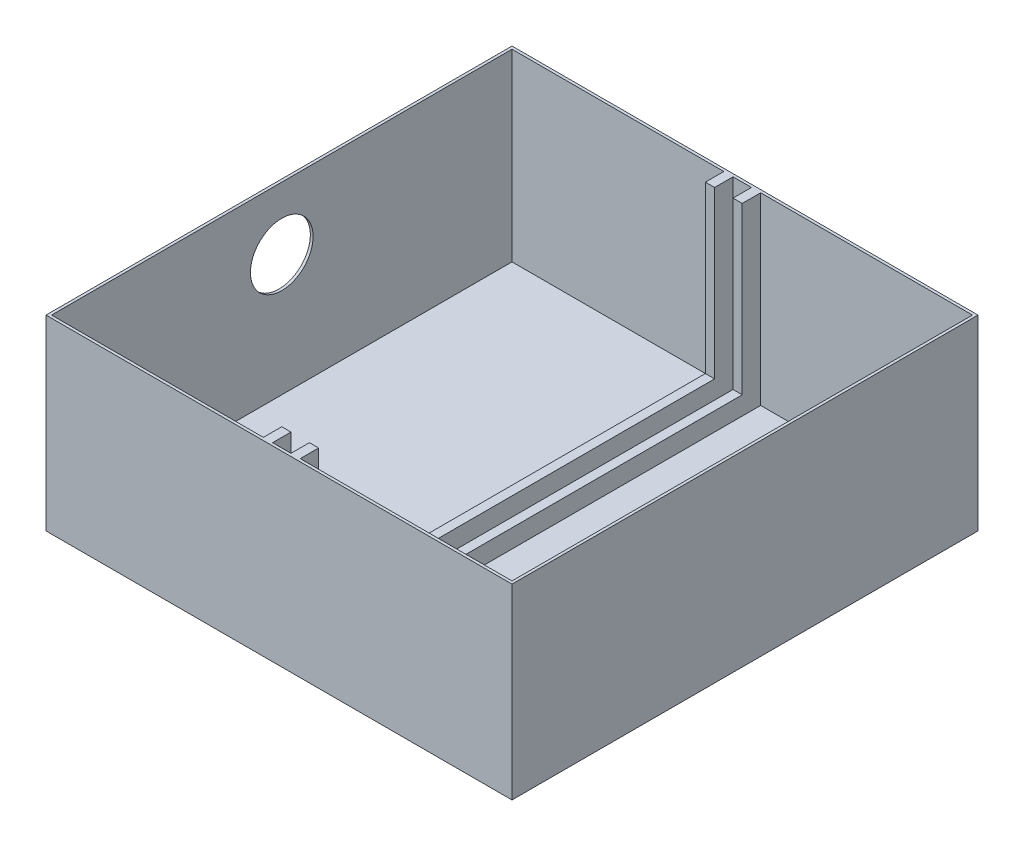
ISO-10303-21;
HEADER;
FILE_DESCRIPTION(('STEP AP214'),'2;1');
FILE_NAME('part.step','',(''),(''),'','','');
FILE_SCHEMA(('AUTOMOTIVE_DESIGN { 1 0 10303 214 1 1 1 1 }'));
ENDSEC;
DATA;
#1=APPLICATION_CONTEXT('core data for automotive mechanical design processes');
#2=APPLICATION_PROTOCOL_DEFINITION('international standard','automotive_design',2000,#1);
#3=PRODUCT_CONTEXT('',#1,'mechanical');
#4=PRODUCT('Part','Part','',(#3));
#5=PRODUCT_RELATED_PRODUCT_CATEGORY('part','',(#4));
#6=PRODUCT_DEFINITION_FORMATION('','',#4);
#7=PRODUCT_DEFINITION_CONTEXT('part definition',#1,'design');
#8=PRODUCT_DEFINITION('design','',#6,#7);
#9=PRODUCT_DEFINITION_SHAPE('','',#8);
#10=(LENGTH_UNIT() NAMED_UNIT(*) SI_UNIT(.MILLI.,.METRE.));
#11=(NAMED_UNIT(*) PLANE_ANGLE_UNIT() SI_UNIT($,.RADIAN.));
#12=(NAMED_UNIT(*) SI_UNIT($,.STERADIAN.) SOLID_ANGLE_UNIT());
#13=UNCERTAINTY_MEASURE_WITH_UNIT(LENGTH_MEASURE(1.E-05),#10,'distance_accuracy_value','');
#14=(GEOMETRIC_REPRESENTATION_CONTEXT(3) GLOBAL_UNCERTAINTY_ASSIGNED_CONTEXT((#13)) GLOBAL_UNIT_ASSIGNED_CONTEXT((#10,
#11,#12)) REPRESENTATION_CONTEXT('',''));
#15=CARTESIAN_POINT('',(0.,0.,0.));
#16=DIRECTION('',(0.,0.,1.));
#17=DIRECTION('',(1.,0.,0.));
#18=AXIS2_PLACEMENT_3D('',#15,#16,#17);
#19=CARTESIAN_POINT('',(0.,1.5,0.));
#20=DIRECTION('',(0.,1.,0.));
#21=DIRECTION('',(0.,0.,1.));
#22=AXIS2_PLACEMENT_3D('',#19,#20,#21);
#23=PLANE('',#22);
#24=DIRECTION('',(0.,0.,1.));
#25=VECTOR('',#24,1.);
#26=CARTESIAN_POINT('',(-5.,1.5,0.));
#27=LINE('',#26,#25);
#28=CARTESIAN_POINT('',(-5.,1.5,-125.));
#29=VERTEX_POINT('',#28);
#30=CARTESIAN_POINT('',(-5.,1.5,125.));
#31=VERTEX_POINT('',#30);
#32=EDGE_CURVE('E299',#29,#31,#27,.T.);
#33=ORIENTED_EDGE('',*,*,#32,.T.);
#34=DIRECTION('',(1.,0.,0.));
#35=VECTOR('',#34,1.);
#36=CARTESIAN_POINT('',(-126.5,1.5,125.));
#37=LINE('',#36,#35);
#38=CARTESIAN_POINT('',(5.,1.5,125.));
#39=VERTEX_POINT('',#38);
#40=EDGE_CURVE('E269',#31,#39,#37,.T.);
#41=ORIENTED_EDGE('',*,*,#40,.T.);
#42=DIRECTION('',(0.,0.,1.));
#43=VECTOR('',#42,1.);
#44=CARTESIAN_POINT('',(5.,1.5,0.));
#45=LINE('',#44,#43);
#46=CARTESIAN_POINT('',(5.,1.5,-125.));
#47=VERTEX_POINT('',#46);
#48=EDGE_CURVE('E317',#47,#39,#45,.T.);
#49=ORIENTED_EDGE('',*,*,#48,.F.);
#50=DIRECTION('',(-1.,0.,0.));
#51=VECTOR('',#50,1.);
#52=CARTESIAN_POINT('',(-126.5,1.5,-125.));
#53=LINE('',#52,#51);
#54=EDGE_CURVE('E284',#47,#29,#53,.T.);
#55=ORIENTED_EDGE('',*,*,#54,.T.);
#56=EDGE_LOOP('',(#33,#41,#49,#55));
#57=FACE_BOUND('',#56,.T.);
#58=ADVANCED_FACE('F43',(#57),#23,.T.);
#59=CARTESIAN_POINT('',(-125.,1.5,125.));
#60=VERTEX_POINT('',#59);
#61=CARTESIAN_POINT('',(-10.,1.5,125.));
#62=VERTEX_POINT('',#61);
#63=EDGE_CURVE('E266',#60,#62,#37,.T.);
#64=ORIENTED_EDGE('',*,*,#63,.T.);
#65=DIRECTION('',(0.,0.,-1.));
#66=VECTOR('',#65,1.);
#67=CARTESIAN_POINT('',(-10.,1.5,0.));
#68=LINE('',#67,#66);
#69=CARTESIAN_POINT('',(-10.,1.5,-125.));
#70=VERTEX_POINT('',#69);
#71=EDGE_CURVE('E214',#62,#70,#68,.T.);
#72=ORIENTED_EDGE('',*,*,#71,.T.);
#73=CARTESIAN_POINT('',(-125.,1.5,-125.));
#74=VERTEX_POINT('',#73);
#75=EDGE_CURVE('E285',#70,#74,#53,.T.);
#76=ORIENTED_EDGE('',*,*,#75,.T.);
#77=DIRECTION('',(0.,0.,1.));
#78=VECTOR('',#77,1.);
#79=CARTESIAN_POINT('',(-125.,1.5,-126.5));
#80=LINE('',#79,#78);
#81=EDGE_CURVE('E274',#74,#60,#80,.T.);
#82=ORIENTED_EDGE('',*,*,#81,.T.);
#83=EDGE_LOOP('',(#64,#72,#76,#82));
#84=FACE_BOUND('',#83,.T.);
#85=ADVANCED_FACE('F507',(#84),#23,.T.);
#86=CARTESIAN_POINT('',(-126.5,101.5,125.));
#87=DIRECTION('',(0.,0.,-1.));
#88=DIRECTION('',(-1.,0.,0.));
#89=AXIS2_PLACEMENT_3D('',#86,#87,#88);
#90=PLANE('',#89);
#91=ORIENTED_EDGE('',*,*,#40,.F.);
#92=DIRECTION('',(0.,-1.,0.));
#93=VECTOR('',#92,1.);
#94=CARTESIAN_POINT('',(-5.,112.680339887499,125.));
#95=LINE('',#94,#93);
#96=CARTESIAN_POINT('',(-5.,101.5,125.));
#97=VERTEX_POINT('',#96);
#98=EDGE_CURVE('E416',#97,#31,#95,.T.);
#99=ORIENTED_EDGE('',*,*,#98,.F.);
#100=DIRECTION('',(1.,0.,0.));
#101=VECTOR('',#100,1.);
#102=CARTESIAN_POINT('',(-126.5,101.5,125.));
#103=LINE('',#102,#101);
#104=CARTESIAN_POINT('',(5.,101.5,125.));
#105=VERTEX_POINT('',#104);
#106=EDGE_CURVE('E67',#97,#105,#103,.T.);
#107=ORIENTED_EDGE('',*,*,#106,.T.);
#108=DIRECTION('',(0.,-1.,0.));
#109=VECTOR('',#108,1.);
#110=CARTESIAN_POINT('',(5.,112.680339887499,125.));
#111=LINE('',#110,#109);
#112=EDGE_CURVE('E234',#105,#39,#111,.T.);
#113=ORIENTED_EDGE('',*,*,#112,.T.);
#114=EDGE_LOOP('',(#91,#99,#107,#113));
#115=FACE_BOUND('',#114,.T.);
#116=ADVANCED_FACE('F513',(#115),#90,.T.);
#117=CARTESIAN_POINT('',(-125.,101.5,125.));
#118=VERTEX_POINT('',#117);
#119=CARTESIAN_POINT('',(-10.,101.5,125.));
#120=VERTEX_POINT('',#119);
#121=EDGE_CURVE('E230',#118,#120,#103,.T.);
#122=ORIENTED_EDGE('',*,*,#121,.T.);
#123=DIRECTION('',(0.,-1.,0.));
#124=VECTOR('',#123,1.);
#125=CARTESIAN_POINT('',(-10.,112.680339887499,125.));
#126=LINE('',#125,#124);
#127=EDGE_CURVE('E207',#120,#62,#126,.T.);
#128=ORIENTED_EDGE('',*,*,#127,.T.);
#129=ORIENTED_EDGE('',*,*,#63,.F.);
#130=DIRECTION('',(0.,-1.,0.));
#131=VECTOR('',#130,1.);
#132=CARTESIAN_POINT('',(-125.,101.5,125.));
#133=LINE('',#132,#131);
#134=EDGE_CURVE('E238',#118,#60,#133,.T.);
#135=ORIENTED_EDGE('',*,*,#134,.F.);
#136=EDGE_LOOP('',(#122,#128,#129,#135));
#137=FACE_BOUND('',#136,.T.);
#138=ADVANCED_FACE('F236',(#137),#90,.T.);
#139=DIRECTION('',(0.,0.,-1.));
#140=VECTOR('',#139,1.);
#141=CARTESIAN_POINT('',(10.,1.5,0.));
#142=LINE('',#141,#140);
#143=CARTESIAN_POINT('',(10.,1.5,125.));
#144=VERTEX_POINT('',#143);
#145=CARTESIAN_POINT('',(10.,1.5,-125.));
#146=VERTEX_POINT('',#145);
#147=EDGE_CURVE('E322',#144,#146,#142,.T.);
#148=ORIENTED_EDGE('',*,*,#147,.F.);
#149=CARTESIAN_POINT('',(125.,1.5,125.));
#150=VERTEX_POINT('',#149);
#151=EDGE_CURVE('E270',#144,#150,#37,.T.);
#152=ORIENTED_EDGE('',*,*,#151,.T.);
#153=DIRECTION('',(0.,0.,-1.));
#154=VECTOR('',#153,1.);
#155=CARTESIAN_POINT('',(125.,1.5,-126.5));
#156=LINE('',#155,#154);
#157=CARTESIAN_POINT('',(125.,1.5,-125.));
#158=VERTEX_POINT('',#157);
#159=EDGE_CURVE('E291',#150,#158,#156,.T.);
#160=ORIENTED_EDGE('',*,*,#159,.T.);
#161=EDGE_CURVE('E277',#158,#146,#53,.T.);
#162=ORIENTED_EDGE('',*,*,#161,.T.);
#163=EDGE_LOOP('',(#148,#152,#160,#162));
#164=FACE_BOUND('',#163,.T.);
#165=ADVANCED_FACE('F509',(#164),#23,.T.);
#166=ORIENTED_EDGE('',*,*,#151,.F.);
#167=DIRECTION('',(0.,-1.,0.));
#168=VECTOR('',#167,1.);
#169=CARTESIAN_POINT('',(10.,112.680339887499,125.));
#170=LINE('',#169,#168);
#171=CARTESIAN_POINT('',(10.,101.5,125.));
#172=VERTEX_POINT('',#171);
#173=EDGE_CURVE('E59',#172,#144,#170,.T.);
#174=ORIENTED_EDGE('',*,*,#173,.F.);
#175=CARTESIAN_POINT('',(125.,101.5,125.));
#176=VERTEX_POINT('',#175);
#177=EDGE_CURVE('E243',#172,#176,#103,.T.);
#178=ORIENTED_EDGE('',*,*,#177,.T.);
#179=DIRECTION('',(0.,-1.,0.));
#180=VECTOR('',#179,1.);
#181=CARTESIAN_POINT('',(125.,101.5,125.));
#182=LINE('',#181,#180);
#183=EDGE_CURVE('E241',#176,#150,#182,.T.);
#184=ORIENTED_EDGE('',*,*,#183,.T.);
#185=EDGE_LOOP('',(#166,#174,#178,#184));
#186=FACE_BOUND('',#185,.T.);
#187=ADVANCED_FACE('F517',(#186),#90,.T.);
#188=CARTESIAN_POINT('',(-126.5,101.5,-125.));
#189=DIRECTION('',(0.,0.,1.));
#190=DIRECTION('',(1.,0.,0.));
#191=AXIS2_PLACEMENT_3D('',#188,#189,#190);
#192=PLANE('',#191);
#193=DIRECTION('',(-1.,0.,0.));
#194=VECTOR('',#193,1.);
#195=CARTESIAN_POINT('',(-126.5,101.5,-125.));
#196=LINE('',#195,#194);
#197=CARTESIAN_POINT('',(125.,101.5,-125.));
#198=VERTEX_POINT('',#197);
#199=CARTESIAN_POINT('',(10.,101.5,-125.));
#200=VERTEX_POINT('',#199);
#201=EDGE_CURVE('E254',#198,#200,#196,.T.);
#202=ORIENTED_EDGE('',*,*,#201,.T.);
#203=DIRECTION('',(0.,-1.,0.));
#204=VECTOR('',#203,1.);
#205=CARTESIAN_POINT('',(10.,112.680339887499,-125.));
#206=LINE('',#205,#204);
#207=EDGE_CURVE('E376',#200,#146,#206,.T.);
#208=ORIENTED_EDGE('',*,*,#207,.T.);
#209=ORIENTED_EDGE('',*,*,#161,.F.);
#210=DIRECTION('',(0.,-1.,0.));
#211=VECTOR('',#210,1.);
#212=CARTESIAN_POINT('',(125.,101.5,-125.));
#213=LINE('',#212,#211);
#214=EDGE_CURVE('E281',#198,#158,#213,.T.);
#215=ORIENTED_EDGE('',*,*,#214,.F.);
#216=EDGE_LOOP('',(#202,#208,#209,#215));
#217=FACE_BOUND('',#216,.T.);
#218=ADVANCED_FACE('F523',(#217),#192,.T.);
#219=ORIENTED_EDGE('',*,*,#54,.F.);
#220=DIRECTION('',(0.,-1.,0.));
#221=VECTOR('',#220,1.);
#222=CARTESIAN_POINT('',(5.,112.680339887499,-125.));
#223=LINE('',#222,#221);
#224=CARTESIAN_POINT('',(5.,101.5,-125.));
#225=VERTEX_POINT('',#224);
#226=EDGE_CURVE('E371',#225,#47,#223,.T.);
#227=ORIENTED_EDGE('',*,*,#226,.F.);
#228=CARTESIAN_POINT('',(-5.,101.5,-125.));
#229=VERTEX_POINT('',#228);
#230=EDGE_CURVE('E259',#225,#229,#196,.T.);
#231=ORIENTED_EDGE('',*,*,#230,.T.);
#232=DIRECTION('',(0.,-1.,0.));
#233=VECTOR('',#232,1.);
#234=CARTESIAN_POINT('',(-5.,112.680339887499,-125.));
#235=LINE('',#234,#233);
#236=EDGE_CURVE('E349',#229,#29,#235,.T.);
#237=ORIENTED_EDGE('',*,*,#236,.T.);
#238=EDGE_LOOP('',(#219,#227,#231,#237));
#239=FACE_BOUND('',#238,.T.);
#240=ADVANCED_FACE('F573',(#239),#192,.T.);
#241=ORIENTED_EDGE('',*,*,#75,.F.);
#242=DIRECTION('',(0.,-1.,0.));
#243=VECTOR('',#242,1.);
#244=CARTESIAN_POINT('',(-10.,112.680339887499,-125.));
#245=LINE('',#244,#243);
#246=CARTESIAN_POINT('',(-10.,101.5,-125.));
#247=VERTEX_POINT('',#246);
#248=EDGE_CURVE('E345',#247,#70,#245,.T.);
#249=ORIENTED_EDGE('',*,*,#248,.F.);
#250=CARTESIAN_POINT('',(-125.,101.5,-125.));
#251=VERTEX_POINT('',#250);
#252=EDGE_CURVE('E261',#247,#251,#196,.T.);
#253=ORIENTED_EDGE('',*,*,#252,.T.);
#254=DIRECTION('',(0.,-1.,0.));
#255=VECTOR('',#254,1.);
#256=CARTESIAN_POINT('',(-125.,101.5,-125.));
#257=LINE('',#256,#255);
#258=EDGE_CURVE('E273',#251,#74,#257,.T.);
#259=ORIENTED_EDGE('',*,*,#258,.T.);
#260=EDGE_LOOP('',(#241,#249,#253,#259));
#261=FACE_BOUND('',#260,.T.);
#262=ADVANCED_FACE('F559',(#261),#192,.T.);
#263=CARTESIAN_POINT('',(126.5,101.5,-126.5));
#264=DIRECTION('',(-1.,0.,0.));
#265=DIRECTION('',(0.,0.,1.));
#266=AXIS2_PLACEMENT_3D('',#263,#264,#265);
#267=PLANE('',#266);
#268=DIRECTION('',(0.,0.,-1.));
#269=VECTOR('',#268,1.);
#270=CARTESIAN_POINT('',(126.5,0.,-126.5));
#271=LINE('',#270,#269);
#272=CARTESIAN_POINT('',(126.5,0.,126.5));
#273=VERTEX_POINT('',#272);
#274=CARTESIAN_POINT('',(126.5,0.,-126.5));
#275=VERTEX_POINT('',#274);
#276=EDGE_CURVE('E290',#273,#275,#271,.T.);
#277=ORIENTED_EDGE('',*,*,#276,.T.);
#278=DIRECTION('',(0.,-1.,0.));
#279=VECTOR('',#278,1.);
#280=CARTESIAN_POINT('',(126.5,101.5,-126.5));
#281=LINE('',#280,#279);
#282=CARTESIAN_POINT('',(126.5,101.5,-126.5));
#283=VERTEX_POINT('',#282);
#284=EDGE_CURVE('E11',#283,#275,#281,.T.);
#285=ORIENTED_EDGE('',*,*,#284,.F.);
#286=DIRECTION('',(0.,0.,-1.));
#287=VECTOR('',#286,1.);
#288=CARTESIAN_POINT('',(126.5,101.5,-126.5));
#289=LINE('',#288,#287);
#290=CARTESIAN_POINT('',(126.5,101.5,126.5));
#291=VERTEX_POINT('',#290);
#292=EDGE_CURVE('E473',#291,#283,#289,.T.);
#293=ORIENTED_EDGE('',*,*,#292,.F.);
#294=DIRECTION('',(0.,-1.,0.));
#295=VECTOR('',#294,1.);
#296=CARTESIAN_POINT('',(126.5,101.5,126.5));
#297=LINE('',#296,#295);
#298=EDGE_CURVE('E467',#291,#273,#297,.T.);
#299=ORIENTED_EDGE('',*,*,#298,.T.);
#300=EDGE_LOOP('',(#277,#285,#293,#299));
#301=FACE_BOUND('',#300,.T.);
#302=ADVANCED_FACE('F45',(#301),#267,.F.);
#303=CARTESIAN_POINT('',(-126.5,101.5,-126.5));
#304=DIRECTION('',(0.,0.,1.));
#305=DIRECTION('',(1.,0.,0.));
#306=AXIS2_PLACEMENT_3D('',#303,#304,#305);
#307=PLANE('',#306);
#308=DIRECTION('',(-1.,0.,0.));
#309=VECTOR('',#308,1.);
#310=CARTESIAN_POINT('',(-126.5,0.,-126.5));
#311=LINE('',#310,#309);
#312=CARTESIAN_POINT('',(-126.5,0.,-126.5));
#313=VERTEX_POINT('',#312);
#314=EDGE_CURVE('E460',#275,#313,#311,.T.);
#315=ORIENTED_EDGE('',*,*,#314,.T.);
#316=DIRECTION('',(0.,-1.,0.));
#317=VECTOR('',#316,1.);
#318=CARTESIAN_POINT('',(-126.5,101.5,-126.5));
#319=LINE('',#318,#317);
#320=CARTESIAN_POINT('',(-126.5,101.5,-126.5));
#321=VERTEX_POINT('',#320);
#322=EDGE_CURVE('E52',#321,#313,#319,.T.);
#323=ORIENTED_EDGE('',*,*,#322,.F.);
#324=DIRECTION('',(-1.,0.,0.));
#325=VECTOR('',#324,1.);
#326=CARTESIAN_POINT('',(-126.5,101.5,-126.5));
#327=LINE('',#326,#325);
#328=EDGE_CURVE('E477',#283,#321,#327,.T.);
#329=ORIENTED_EDGE('',*,*,#328,.F.);
#330=ORIENTED_EDGE('',*,*,#284,.T.);
#331=EDGE_LOOP('',(#315,#323,#329,#330));
#332=FACE_BOUND('',#331,.T.);
#333=ADVANCED_FACE('F445',(#332),#307,.F.);
#334=CARTESIAN_POINT('',(-126.5,101.5,-126.5));
#335=DIRECTION('',(1.,0.,0.));
#336=DIRECTION('',(0.,0.,-1.));
#337=AXIS2_PLACEMENT_3D('',#334,#335,#336);
#338=PLANE('',#337);
#339=CARTESIAN_POINT('',(-126.5,67.5,0.));
#340=DIRECTION('',(-1.,0.,0.));
#341=DIRECTION('',(0.,0.,1.));
#342=AXIS2_PLACEMENT_3D('',#339,#340,#341);
#343=CIRCLE('',#342,17.);
#344=CARTESIAN_POINT('',(-126.5,67.5,17.));
#345=VERTEX_POINT('',#344);
#346=EDGE_CURVE('E433',#345,#345,#343,.T.);
#347=ORIENTED_EDGE('',*,*,#346,.F.);
#348=EDGE_LOOP('',(#347));
#349=FACE_BOUND('',#348,.T.);
#350=DIRECTION('',(0.,0.,1.));
#351=VECTOR('',#350,1.);
#352=CARTESIAN_POINT('',(-126.5,0.,-126.5));
#353=LINE('',#352,#351);
#354=CARTESIAN_POINT('',(-126.5,0.,126.5));
#355=VERTEX_POINT('',#354);
#356=EDGE_CURVE('E450',#313,#355,#353,.T.);
#357=ORIENTED_EDGE('',*,*,#356,.T.);
#358=DIRECTION('',(0.,-1.,0.));
#359=VECTOR('',#358,1.);
#360=CARTESIAN_POINT('',(-126.5,101.5,126.5));
#361=LINE('',#360,#359);
#362=CARTESIAN_POINT('',(-126.5,101.5,126.5));
#363=VERTEX_POINT('',#362);
#364=EDGE_CURVE('E453',#363,#355,#361,.T.);
#365=ORIENTED_EDGE('',*,*,#364,.F.);
#366=DIRECTION('',(0.,0.,1.));
#367=VECTOR('',#366,1.);
#368=CARTESIAN_POINT('',(-126.5,101.5,-126.5));
#369=LINE('',#368,#367);
#370=EDGE_CURVE('E484',#321,#363,#369,.T.);
#371=ORIENTED_EDGE('',*,*,#370,.F.);
#372=ORIENTED_EDGE('',*,*,#322,.T.);
#373=EDGE_LOOP('',(#357,#365,#371,#372));
#374=FACE_BOUND('',#373,.T.);
#375=ADVANCED_FACE('F441',(#349,#374),#338,.F.);
#376=CARTESIAN_POINT('',(-126.5,101.5,126.5));
#377=DIRECTION('',(0.,0.,-1.));
#378=DIRECTION('',(-1.,0.,0.));
#379=AXIS2_PLACEMENT_3D('',#376,#377,#378);
#380=PLANE('',#379);
#381=DIRECTION('',(1.,0.,0.));
#382=VECTOR('',#381,1.);
#383=CARTESIAN_POINT('',(-126.5,0.,126.5));
#384=LINE('',#383,#382);
#385=EDGE_CURVE('E459',#355,#273,#384,.T.);
#386=ORIENTED_EDGE('',*,*,#385,.T.);
#387=ORIENTED_EDGE('',*,*,#298,.F.);
#388=DIRECTION('',(1.,0.,0.));
#389=VECTOR('',#388,1.);
#390=CARTESIAN_POINT('',(-126.5,101.5,126.5));
#391=LINE('',#390,#389);
#392=EDGE_CURVE('E465',#363,#291,#391,.T.);
#393=ORIENTED_EDGE('',*,*,#392,.F.);
#394=ORIENTED_EDGE('',*,*,#364,.T.);
#395=EDGE_LOOP('',(#386,#387,#393,#394));
#396=FACE_BOUND('',#395,.T.);
#397=ADVANCED_FACE('F444',(#396),#380,.F.);
#398=CARTESIAN_POINT('',(0.,101.5,0.));
#399=DIRECTION('',(0.,1.,0.));
#400=DIRECTION('',(0.,0.,1.));
#401=AXIS2_PLACEMENT_3D('',#398,#399,#400);
#402=PLANE('',#401);
#403=DIRECTION('',(0.,0.,-1.));
#404=VECTOR('',#403,1.);
#405=CARTESIAN_POINT('',(125.,101.5,-126.5));
#406=LINE('',#405,#404);
#407=EDGE_CURVE('E263',#176,#198,#406,.T.);
#408=ORIENTED_EDGE('',*,*,#407,.F.);
#409=ORIENTED_EDGE('',*,*,#177,.F.);
#410=DIRECTION('',(0.,0.,-1.));
#411=VECTOR('',#410,1.);
#412=CARTESIAN_POINT('',(10.,101.5,115.));
#413=LINE('',#412,#411);
#414=CARTESIAN_POINT('',(10.,101.5,115.));
#415=VERTEX_POINT('',#414);
#416=EDGE_CURVE('E409',#172,#415,#413,.T.);
#417=ORIENTED_EDGE('',*,*,#416,.T.);
#418=DIRECTION('',(-1.,0.,0.));
#419=VECTOR('',#418,1.);
#420=CARTESIAN_POINT('',(5.,101.5,115.));
#421=LINE('',#420,#419);
#422=CARTESIAN_POINT('',(5.,101.5,115.));
#423=VERTEX_POINT('',#422);
#424=EDGE_CURVE('E370',#415,#423,#421,.T.);
#425=ORIENTED_EDGE('',*,*,#424,.T.);
#426=DIRECTION('',(0.,0.,1.));
#427=VECTOR('',#426,1.);
#428=CARTESIAN_POINT('',(5.,101.5,125.));
#429=LINE('',#428,#427);
#430=EDGE_CURVE('E399',#423,#105,#429,.T.);
#431=ORIENTED_EDGE('',*,*,#430,.T.);
#432=ORIENTED_EDGE('',*,*,#106,.F.);
#433=DIRECTION('',(0.,0.,-1.));
#434=VECTOR('',#433,1.);
#435=CARTESIAN_POINT('',(-5.,101.5,125.));
#436=LINE('',#435,#434);
#437=CARTESIAN_POINT('',(-5.,101.5,115.));
#438=VERTEX_POINT('',#437);
#439=EDGE_CURVE('E220',#97,#438,#436,.T.);
#440=ORIENTED_EDGE('',*,*,#439,.T.);
#441=DIRECTION('',(-1.,0.,0.));
#442=VECTOR('',#441,1.);
#443=CARTESIAN_POINT('',(-5.,101.5,115.));
#444=LINE('',#443,#442);
#445=CARTESIAN_POINT('',(-10.,101.5,115.));
#446=VERTEX_POINT('',#445);
#447=EDGE_CURVE('E232',#438,#446,#444,.T.);
#448=ORIENTED_EDGE('',*,*,#447,.T.);
#449=DIRECTION('',(0.,0.,1.));
#450=VECTOR('',#449,1.);
#451=CARTESIAN_POINT('',(-10.,101.5,115.));
#452=LINE('',#451,#450);
#453=EDGE_CURVE('E211',#446,#120,#452,.T.);
#454=ORIENTED_EDGE('',*,*,#453,.T.);
#455=ORIENTED_EDGE('',*,*,#121,.F.);
#456=DIRECTION('',(0.,0.,1.));
#457=VECTOR('',#456,1.);
#458=CARTESIAN_POINT('',(-125.,101.5,-126.5));
#459=LINE('',#458,#457);
#460=EDGE_CURVE('E251',#251,#118,#459,.T.);
#461=ORIENTED_EDGE('',*,*,#460,.F.);
#462=ORIENTED_EDGE('',*,*,#252,.F.);
#463=DIRECTION('',(0.,0.,1.));
#464=VECTOR('',#463,1.);
#465=CARTESIAN_POINT('',(-10.,101.5,-115.));
#466=LINE('',#465,#464);
#467=CARTESIAN_POINT('',(-10.,101.5,-115.));
#468=VERTEX_POINT('',#467);
#469=EDGE_CURVE('E348',#247,#468,#466,.T.);
#470=ORIENTED_EDGE('',*,*,#469,.T.);
#471=DIRECTION('',(1.,0.,0.));
#472=VECTOR('',#471,1.);
#473=CARTESIAN_POINT('',(-5.,101.5,-115.));
#474=LINE('',#473,#472);
#475=CARTESIAN_POINT('',(-5.,101.5,-115.));
#476=VERTEX_POINT('',#475);
#477=EDGE_CURVE('E359',#468,#476,#474,.T.);
#478=ORIENTED_EDGE('',*,*,#477,.T.);
#479=DIRECTION('',(0.,0.,-1.));
#480=VECTOR('',#479,1.);
#481=CARTESIAN_POINT('',(-5.,101.5,-125.));
#482=LINE('',#481,#480);
#483=EDGE_CURVE('E325',#476,#229,#482,.T.);
#484=ORIENTED_EDGE('',*,*,#483,.T.);
#485=ORIENTED_EDGE('',*,*,#230,.F.);
#486=DIRECTION('',(0.,0.,1.));
#487=VECTOR('',#486,1.);
#488=CARTESIAN_POINT('',(5.,101.5,-125.));
#489=LINE('',#488,#487);
#490=CARTESIAN_POINT('',(5.,101.5,-115.));
#491=VERTEX_POINT('',#490);
#492=EDGE_CURVE('E375',#225,#491,#489,.T.);
#493=ORIENTED_EDGE('',*,*,#492,.T.);
#494=DIRECTION('',(1.,0.,0.));
#495=VECTOR('',#494,1.);
#496=CARTESIAN_POINT('',(5.,101.5,-115.));
#497=LINE('',#496,#495);
#498=CARTESIAN_POINT('',(10.,101.5,-115.));
#499=VERTEX_POINT('',#498);
#500=EDGE_CURVE('E386',#491,#499,#497,.T.);
#501=ORIENTED_EDGE('',*,*,#500,.T.);
#502=DIRECTION('',(0.,0.,-1.));
#503=VECTOR('',#502,1.);
#504=CARTESIAN_POINT('',(10.,101.5,-115.));
#505=LINE('',#504,#503);
#506=EDGE_CURVE('E344',#499,#200,#505,.T.);
#507=ORIENTED_EDGE('',*,*,#506,.T.);
#508=ORIENTED_EDGE('',*,*,#201,.F.);
#509=EDGE_LOOP('',(#408,#409,#417,#425,#431,#432,#440,#448,#454,#455,#461,#462,#470,#478,#484,
#485,#493,#501,#507,#508));
#510=FACE_BOUND('',#509,.T.);
#511=ORIENTED_EDGE('',*,*,#292,.T.);
#512=ORIENTED_EDGE('',*,*,#328,.T.);
#513=ORIENTED_EDGE('',*,*,#370,.T.);
#514=ORIENTED_EDGE('',*,*,#392,.T.);
#515=EDGE_LOOP('',(#511,#512,#513,#514));
#516=FACE_BOUND('',#515,.T.);
#517=ADVANCED_FACE('F227',(#510,#516),#402,.T.);
#518=CARTESIAN_POINT('',(0.,0.,0.));
#519=DIRECTION('',(0.,1.,0.));
#520=DIRECTION('',(0.,0.,1.));
#521=AXIS2_PLACEMENT_3D('',#518,#519,#520);
#522=PLANE('',#521);
#523=ORIENTED_EDGE('',*,*,#276,.F.);
#524=ORIENTED_EDGE('',*,*,#385,.F.);
#525=ORIENTED_EDGE('',*,*,#356,.F.);
#526=ORIENTED_EDGE('',*,*,#314,.F.);
#527=EDGE_LOOP('',(#523,#524,#525,#526));
#528=FACE_BOUND('',#527,.T.);
#529=ADVANCED_FACE('F470',(#528),#522,.F.);
#530=CARTESIAN_POINT('',(125.,101.5,-126.5));
#531=DIRECTION('',(-1.,0.,0.));
#532=DIRECTION('',(0.,0.,1.));
#533=AXIS2_PLACEMENT_3D('',#530,#531,#532);
#534=PLANE('',#533);
#535=ORIENTED_EDGE('',*,*,#159,.F.);
#536=ORIENTED_EDGE('',*,*,#183,.F.);
#537=ORIENTED_EDGE('',*,*,#407,.T.);
#538=ORIENTED_EDGE('',*,*,#214,.T.);
#539=EDGE_LOOP('',(#535,#536,#537,#538));
#540=FACE_BOUND('',#539,.T.);
#541=ADVANCED_FACE('F502',(#540),#534,.T.);
#542=CARTESIAN_POINT('',(-125.,101.5,-126.5));
#543=DIRECTION('',(1.,0.,0.));
#544=DIRECTION('',(0.,0.,-1.));
#545=AXIS2_PLACEMENT_3D('',#542,#543,#544);
#546=PLANE('',#545);
#547=CARTESIAN_POINT('',(-125.,67.5,0.));
#548=DIRECTION('',(1.,0.,0.));
#549=DIRECTION('',(0.,0.,-1.));
#550=AXIS2_PLACEMENT_3D('',#547,#548,#549);
#551=CIRCLE('',#550,17.);
#552=CARTESIAN_POINT('',(-125.,67.5,-17.));
#553=VERTEX_POINT('',#552);
#554=EDGE_CURVE('E420',#553,#553,#551,.F.);
#555=ORIENTED_EDGE('',*,*,#554,.T.);
#556=EDGE_LOOP('',(#555));
#557=FACE_BOUND('',#556,.T.);
#558=ORIENTED_EDGE('',*,*,#81,.F.);
#559=ORIENTED_EDGE('',*,*,#258,.F.);
#560=ORIENTED_EDGE('',*,*,#460,.T.);
#561=ORIENTED_EDGE('',*,*,#134,.T.);
#562=EDGE_LOOP('',(#558,#559,#560,#561));
#563=FACE_BOUND('',#562,.T.);
#564=ADVANCED_FACE('F561',(#557,#563),#546,.T.);
#565=CARTESIAN_POINT('',(-5.,11.5,0.));
#566=DIRECTION('',(1.,0.,0.));
#567=DIRECTION('',(0.,0.,-1.));
#568=AXIS2_PLACEMENT_3D('',#565,#566,#567);
#569=PLANE('',#568);
#570=ORIENTED_EDGE('',*,*,#32,.F.);
#571=ORIENTED_EDGE('',*,*,#236,.F.);
#572=ORIENTED_EDGE('',*,*,#483,.F.);
#573=DIRECTION('',(0.,-1.,0.));
#574=VECTOR('',#573,1.);
#575=CARTESIAN_POINT('',(-5.,112.680339887499,-115.));
#576=LINE('',#575,#574);
#577=CARTESIAN_POINT('',(-5.,11.5,-115.));
#578=VERTEX_POINT('',#577);
#579=EDGE_CURVE('E343',#476,#578,#576,.T.);
#580=ORIENTED_EDGE('',*,*,#579,.T.);
#581=DIRECTION('',(0.,0.,1.));
#582=VECTOR('',#581,1.);
#583=CARTESIAN_POINT('',(-5.,11.5,0.));
#584=LINE('',#583,#582);
#585=CARTESIAN_POINT('',(-5.,11.5,115.));
#586=VERTEX_POINT('',#585);
#587=EDGE_CURVE('E298',#578,#586,#584,.T.);
#588=ORIENTED_EDGE('',*,*,#587,.T.);
#589=DIRECTION('',(0.,-1.,0.));
#590=VECTOR('',#589,1.);
#591=CARTESIAN_POINT('',(-5.,112.680339887499,115.));
#592=LINE('',#591,#590);
#593=EDGE_CURVE('E419',#438,#586,#592,.T.);
#594=ORIENTED_EDGE('',*,*,#593,.F.);
#595=ORIENTED_EDGE('',*,*,#439,.F.);
#596=ORIENTED_EDGE('',*,*,#98,.T.);
#597=EDGE_LOOP('',(#570,#571,#572,#580,#588,#594,#595,#596));
#598=FACE_BOUND('',#597,.T.);
#599=ADVANCED_FACE('F551',(#598),#569,.T.);
#600=CARTESIAN_POINT('',(-10.,11.5,0.));
#601=DIRECTION('',(-1.,0.,0.));
#602=DIRECTION('',(0.,0.,1.));
#603=AXIS2_PLACEMENT_3D('',#600,#601,#602);
#604=PLANE('',#603);
#605=ORIENTED_EDGE('',*,*,#71,.F.);
#606=ORIENTED_EDGE('',*,*,#127,.F.);
#607=ORIENTED_EDGE('',*,*,#453,.F.);
#608=DIRECTION('',(0.,-1.,0.));
#609=VECTOR('',#608,1.);
#610=CARTESIAN_POINT('',(-10.,112.680339887499,115.));
#611=LINE('',#610,#609);
#612=CARTESIAN_POINT('',(-10.,11.5,115.));
#613=VERTEX_POINT('',#612);
#614=EDGE_CURVE('E221',#446,#613,#611,.T.);
#615=ORIENTED_EDGE('',*,*,#614,.T.);
#616=DIRECTION('',(0.,0.,-1.));
#617=VECTOR('',#616,1.);
#618=CARTESIAN_POINT('',(-10.,11.5,0.));
#619=LINE('',#618,#617);
#620=CARTESIAN_POINT('',(-10.,11.5,-115.));
#621=VERTEX_POINT('',#620);
#622=EDGE_CURVE('E306',#613,#621,#619,.T.);
#623=ORIENTED_EDGE('',*,*,#622,.T.);
#624=DIRECTION('',(0.,-1.,0.));
#625=VECTOR('',#624,1.);
#626=CARTESIAN_POINT('',(-10.,112.680339887499,-115.));
#627=LINE('',#626,#625);
#628=EDGE_CURVE('E339',#468,#621,#627,.T.);
#629=ORIENTED_EDGE('',*,*,#628,.F.);
#630=ORIENTED_EDGE('',*,*,#469,.F.);
#631=ORIENTED_EDGE('',*,*,#248,.T.);
#632=EDGE_LOOP('',(#605,#606,#607,#615,#623,#629,#630,#631));
#633=FACE_BOUND('',#632,.T.);
#634=ADVANCED_FACE('F209',(#633),#604,.T.);
#635=CARTESIAN_POINT('',(0.,11.5,0.));
#636=DIRECTION('',(0.,1.,0.));
#637=DIRECTION('',(0.,0.,1.));
#638=AXIS2_PLACEMENT_3D('',#635,#636,#637);
#639=PLANE('',#638);
#640=ORIENTED_EDGE('',*,*,#587,.F.);
#641=DIRECTION('',(1.,0.,0.));
#642=VECTOR('',#641,1.);
#643=CARTESIAN_POINT('',(0.,11.5,-115.));
#644=LINE('',#643,#642);
#645=EDGE_CURVE('E310',#621,#578,#644,.T.);
#646=ORIENTED_EDGE('',*,*,#645,.F.);
#647=ORIENTED_EDGE('',*,*,#622,.F.);
#648=DIRECTION('',(1.,0.,0.));
#649=VECTOR('',#648,1.);
#650=CARTESIAN_POINT('',(0.,11.5,115.));
#651=LINE('',#650,#649);
#652=EDGE_CURVE('E295',#613,#586,#651,.T.);
#653=ORIENTED_EDGE('',*,*,#652,.T.);
#654=EDGE_LOOP('',(#640,#646,#647,#653));
#655=FACE_BOUND('',#654,.T.);
#656=ADVANCED_FACE('F577',(#655),#639,.T.);
#657=CARTESIAN_POINT('',(10.,11.5,0.));
#658=DIRECTION('',(-1.,0.,0.));
#659=DIRECTION('',(0.,0.,1.));
#660=AXIS2_PLACEMENT_3D('',#657,#658,#659);
#661=PLANE('',#660);
#662=ORIENTED_EDGE('',*,*,#147,.T.);
#663=ORIENTED_EDGE('',*,*,#207,.F.);
#664=ORIENTED_EDGE('',*,*,#506,.F.);
#665=DIRECTION('',(0.,-1.,0.));
#666=VECTOR('',#665,1.);
#667=CARTESIAN_POINT('',(10.,112.680339887499,-115.));
#668=LINE('',#667,#666);
#669=CARTESIAN_POINT('',(10.,11.5,-115.));
#670=VERTEX_POINT('',#669);
#671=EDGE_CURVE('E369',#499,#670,#668,.T.);
#672=ORIENTED_EDGE('',*,*,#671,.T.);
#673=DIRECTION('',(0.,0.,-1.));
#674=VECTOR('',#673,1.);
#675=CARTESIAN_POINT('',(10.,11.5,0.));
#676=LINE('',#675,#674);
#677=CARTESIAN_POINT('',(10.,11.5,115.));
#678=VERTEX_POINT('',#677);
#679=EDGE_CURVE('E332',#678,#670,#676,.T.);
#680=ORIENTED_EDGE('',*,*,#679,.F.);
#681=DIRECTION('',(0.,-1.,0.));
#682=VECTOR('',#681,1.);
#683=CARTESIAN_POINT('',(10.,112.680339887499,115.));
#684=LINE('',#683,#682);
#685=EDGE_CURVE('E400',#415,#678,#684,.T.);
#686=ORIENTED_EDGE('',*,*,#685,.F.);
#687=ORIENTED_EDGE('',*,*,#416,.F.);
#688=ORIENTED_EDGE('',*,*,#173,.T.);
#689=EDGE_LOOP('',(#662,#663,#664,#672,#680,#686,#687,#688));
#690=FACE_BOUND('',#689,.T.);
#691=ADVANCED_FACE('F528',(#690),#661,.F.);
#692=CARTESIAN_POINT('',(5.,11.5,0.));
#693=DIRECTION('',(1.,0.,0.));
#694=DIRECTION('',(0.,0.,-1.));
#695=AXIS2_PLACEMENT_3D('',#692,#693,#694);
#696=PLANE('',#695);
#697=ORIENTED_EDGE('',*,*,#48,.T.);
#698=ORIENTED_EDGE('',*,*,#112,.F.);
#699=ORIENTED_EDGE('',*,*,#430,.F.);
#700=DIRECTION('',(0.,-1.,0.));
#701=VECTOR('',#700,1.);
#702=CARTESIAN_POINT('',(5.,112.680339887499,115.));
#703=LINE('',#702,#701);
#704=CARTESIAN_POINT('',(5.,11.5,115.));
#705=VERTEX_POINT('',#704);
#706=EDGE_CURVE('E395',#423,#705,#703,.T.);
#707=ORIENTED_EDGE('',*,*,#706,.T.);
#708=DIRECTION('',(0.,0.,1.));
#709=VECTOR('',#708,1.);
#710=CARTESIAN_POINT('',(5.,11.5,0.));
#711=LINE('',#710,#709);
#712=CARTESIAN_POINT('',(5.,11.5,-115.));
#713=VERTEX_POINT('',#712);
#714=EDGE_CURVE('E302',#713,#705,#711,.T.);
#715=ORIENTED_EDGE('',*,*,#714,.F.);
#716=DIRECTION('',(0.,-1.,0.));
#717=VECTOR('',#716,1.);
#718=CARTESIAN_POINT('',(5.,112.680339887499,-115.));
#719=LINE('',#718,#717);
#720=EDGE_CURVE('E366',#491,#713,#719,.T.);
#721=ORIENTED_EDGE('',*,*,#720,.F.);
#722=ORIENTED_EDGE('',*,*,#492,.F.);
#723=ORIENTED_EDGE('',*,*,#226,.T.);
#724=EDGE_LOOP('',(#697,#698,#699,#707,#715,#721,#722,#723));
#725=FACE_BOUND('',#724,.T.);
#726=ADVANCED_FACE('F547',(#725),#696,.F.);
#727=CARTESIAN_POINT('',(0.,11.5,0.));
#728=DIRECTION('',(0.,1.,0.));
#729=DIRECTION('',(0.,0.,1.));
#730=AXIS2_PLACEMENT_3D('',#727,#728,#729);
#731=PLANE('',#730);
#732=DIRECTION('',(-1.,0.,0.));
#733=VECTOR('',#732,1.);
#734=CARTESIAN_POINT('',(0.,11.5,115.));
#735=LINE('',#734,#733);
#736=EDGE_CURVE('E321',#678,#705,#735,.T.);
#737=ORIENTED_EDGE('',*,*,#736,.F.);
#738=ORIENTED_EDGE('',*,*,#679,.T.);
#739=DIRECTION('',(-1.,0.,0.));
#740=VECTOR('',#739,1.);
#741=CARTESIAN_POINT('',(0.,11.5,-115.));
#742=LINE('',#741,#740);
#743=EDGE_CURVE('E328',#670,#713,#742,.T.);
#744=ORIENTED_EDGE('',*,*,#743,.T.);
#745=ORIENTED_EDGE('',*,*,#714,.T.);
#746=EDGE_LOOP('',(#737,#738,#744,#745));
#747=FACE_BOUND('',#746,.T.);
#748=ADVANCED_FACE('F541',(#747),#731,.T.);
#749=CARTESIAN_POINT('',(-5.,112.680339887499,-115.));
#750=DIRECTION('',(0.,0.,-1.));
#751=DIRECTION('',(-1.,0.,0.));
#752=AXIS2_PLACEMENT_3D('',#749,#750,#751);
#753=PLANE('',#752);
#754=ORIENTED_EDGE('',*,*,#645,.T.);
#755=ORIENTED_EDGE('',*,*,#579,.F.);
#756=ORIENTED_EDGE('',*,*,#477,.F.);
#757=ORIENTED_EDGE('',*,*,#628,.T.);
#758=EDGE_LOOP('',(#754,#755,#756,#757));
#759=FACE_BOUND('',#758,.T.);
#760=ADVANCED_FACE('F587',(#759),#753,.F.);
#761=CARTESIAN_POINT('',(5.,112.680339887499,-115.));
#762=DIRECTION('',(0.,0.,-1.));
#763=DIRECTION('',(-1.,0.,0.));
#764=AXIS2_PLACEMENT_3D('',#761,#762,#763);
#765=PLANE('',#764);
#766=ORIENTED_EDGE('',*,*,#743,.F.);
#767=ORIENTED_EDGE('',*,*,#671,.F.);
#768=ORIENTED_EDGE('',*,*,#500,.F.);
#769=ORIENTED_EDGE('',*,*,#720,.T.);
#770=EDGE_LOOP('',(#766,#767,#768,#769));
#771=FACE_BOUND('',#770,.T.);
#772=ADVANCED_FACE('F538',(#771),#765,.F.);
#773=CARTESIAN_POINT('',(5.,112.680339887499,115.));
#774=DIRECTION('',(0.,0.,1.));
#775=DIRECTION('',(1.,0.,0.));
#776=AXIS2_PLACEMENT_3D('',#773,#774,#775);
#777=PLANE('',#776);
#778=ORIENTED_EDGE('',*,*,#736,.T.);
#779=ORIENTED_EDGE('',*,*,#706,.F.);
#780=ORIENTED_EDGE('',*,*,#424,.F.);
#781=ORIENTED_EDGE('',*,*,#685,.T.);
#782=EDGE_LOOP('',(#778,#779,#780,#781));
#783=FACE_BOUND('',#782,.T.);
#784=ADVANCED_FACE('F544',(#783),#777,.F.);
#785=CARTESIAN_POINT('',(-5.,112.680339887499,115.));
#786=DIRECTION('',(0.,0.,1.));
#787=DIRECTION('',(1.,0.,0.));
#788=AXIS2_PLACEMENT_3D('',#785,#786,#787);
#789=PLANE('',#788);
#790=ORIENTED_EDGE('',*,*,#652,.F.);
#791=ORIENTED_EDGE('',*,*,#614,.F.);
#792=ORIENTED_EDGE('',*,*,#447,.F.);
#793=ORIENTED_EDGE('',*,*,#593,.T.);
#794=EDGE_LOOP('',(#790,#791,#792,#793));
#795=FACE_BOUND('',#794,.T.);
#796=ADVANCED_FACE('F595',(#795),#789,.F.);
#797=CARTESIAN_POINT('',(-76.9167388793147,67.5,0.));
#798=DIRECTION('',(-1.,0.,0.));
#799=DIRECTION('',(0.,0.,1.));
#800=AXIS2_PLACEMENT_3D('',#797,#798,#799);
#801=CYLINDRICAL_SURFACE('',#800,17.);
#802=ORIENTED_EDGE('',*,*,#346,.T.);
#803=EDGE_LOOP('',(#802));
#804=FACE_BOUND('',#803,.T.);
#805=ORIENTED_EDGE('',*,*,#554,.F.);
#806=EDGE_LOOP('',(#805));
#807=FACE_BOUND('',#806,.T.);
#808=ADVANCED_FACE('F438',(#804,#807),#801,.F.);
#809=CLOSED_SHELL('',(#58,#85,#116,#138,#165,#187,#218,#240,#262,#302,#333,#375,#397,#517,#529,
#541,#564,#599,#634,#656,#691,#726,#748,#760,#772,#784,#796,#808));
#810=MANIFOLD_SOLID_BREP('B2',#809);
#811=ADVANCED_BREP_SHAPE_REPRESENTATION('',(#18,#810),#14);
#812=SHAPE_DEFINITION_REPRESENTATION(#9,#811);
ENDSEC;
END-ISO-10303-21;
